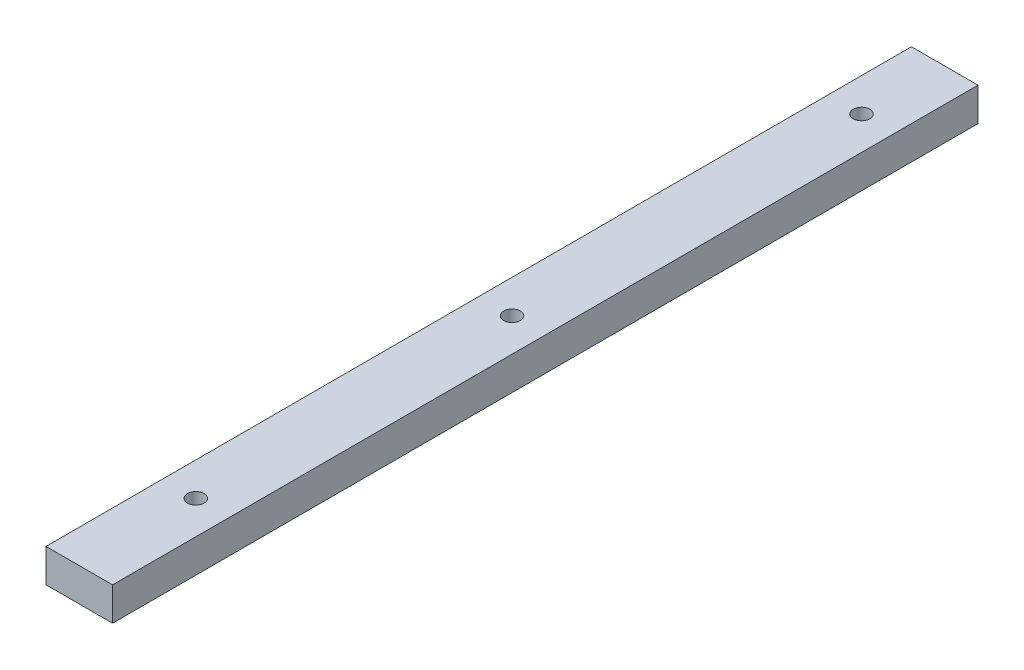
ISO-10303-21;
HEADER;
FILE_DESCRIPTION(('STEP AP214'),'2;1');
FILE_NAME('part.step','',(''),(''),'','','');
FILE_SCHEMA(('AUTOMOTIVE_DESIGN { 1 0 10303 214 1 1 1 1 }'));
ENDSEC;
DATA;
#1=APPLICATION_CONTEXT('core data for automotive mechanical design processes');
#2=APPLICATION_PROTOCOL_DEFINITION('international standard','automotive_design',2000,#1);
#3=PRODUCT_CONTEXT('',#1,'mechanical');
#4=PRODUCT('Part','Part','',(#3));
#5=PRODUCT_RELATED_PRODUCT_CATEGORY('part','',(#4));
#6=PRODUCT_DEFINITION_FORMATION('','',#4);
#7=PRODUCT_DEFINITION_CONTEXT('part definition',#1,'design');
#8=PRODUCT_DEFINITION('design','',#6,#7);
#9=PRODUCT_DEFINITION_SHAPE('','',#8);
#10=(LENGTH_UNIT() NAMED_UNIT(*) SI_UNIT(.MILLI.,.METRE.));
#11=(NAMED_UNIT(*) PLANE_ANGLE_UNIT() SI_UNIT($,.RADIAN.));
#12=(NAMED_UNIT(*) SI_UNIT($,.STERADIAN.) SOLID_ANGLE_UNIT());
#13=UNCERTAINTY_MEASURE_WITH_UNIT(LENGTH_MEASURE(1.E-05),#10,'distance_accuracy_value','');
#14=(GEOMETRIC_REPRESENTATION_CONTEXT(3) GLOBAL_UNCERTAINTY_ASSIGNED_CONTEXT((#13)) GLOBAL_UNIT_ASSIGNED_CONTEXT((#10,
#11,#12)) REPRESENTATION_CONTEXT('',''));
#15=CARTESIAN_POINT('',(0.,0.,0.));
#16=DIRECTION('',(0.,0.,1.));
#17=DIRECTION('',(1.,0.,0.));
#18=AXIS2_PLACEMENT_3D('',#15,#16,#17);
#19=CARTESIAN_POINT('',(0.,0.,660.4));
#20=DIRECTION('',(1.,0.,0.));
#21=DIRECTION('',(0.,0.,-1.));
#22=AXIS2_PLACEMENT_3D('',#19,#20,#21);
#23=PLANE('',#22);
#24=DIRECTION('',(0.,-1.,0.));
#25=VECTOR('',#24,1.);
#26=CARTESIAN_POINT('',(0.,0.,0.));
#27=LINE('',#26,#25);
#28=CARTESIAN_POINT('',(0.,25.4,0.));
#29=VERTEX_POINT('',#28);
#30=CARTESIAN_POINT('',(0.,0.,0.));
#31=VERTEX_POINT('',#30);
#32=EDGE_CURVE('E96',#29,#31,#27,.T.);
#33=ORIENTED_EDGE('',*,*,#32,.T.);
#34=DIRECTION('',(0.,0.,-1.));
#35=VECTOR('',#34,1.);
#36=CARTESIAN_POINT('',(0.,0.,660.4));
#37=LINE('',#36,#35);
#38=CARTESIAN_POINT('',(0.,0.,660.4));
#39=VERTEX_POINT('',#38);
#40=EDGE_CURVE('E11',#39,#31,#37,.T.);
#41=ORIENTED_EDGE('',*,*,#40,.F.);
#42=DIRECTION('',(0.,-1.,0.));
#43=VECTOR('',#42,1.);
#44=CARTESIAN_POINT('',(0.,0.,660.4));
#45=LINE('',#44,#43);
#46=CARTESIAN_POINT('',(0.,25.4,660.4));
#47=VERTEX_POINT('',#46);
#48=EDGE_CURVE('E84',#47,#39,#45,.T.);
#49=ORIENTED_EDGE('',*,*,#48,.F.);
#50=DIRECTION('',(0.,0.,-1.));
#51=VECTOR('',#50,1.);
#52=CARTESIAN_POINT('',(0.,25.4,660.4));
#53=LINE('',#52,#51);
#54=EDGE_CURVE('E92',#47,#29,#53,.T.);
#55=ORIENTED_EDGE('',*,*,#54,.T.);
#56=EDGE_LOOP('',(#33,#41,#49,#55));
#57=FACE_BOUND('',#56,.T.);
#58=ADVANCED_FACE('F33',(#57),#23,.F.);
#59=CARTESIAN_POINT('',(0.,0.,660.4));
#60=DIRECTION('',(0.,1.,0.));
#61=DIRECTION('',(0.,0.,1.));
#62=AXIS2_PLACEMENT_3D('',#59,#60,#61);
#63=PLANE('',#62);
#64=CARTESIAN_POINT('',(25.4,0.,63.5));
#65=DIRECTION('',(0.,1.,0.));
#66=DIRECTION('',(0.,0.,1.));
#67=AXIS2_PLACEMENT_3D('',#64,#65,#66);
#68=CIRCLE('',#67,6.35);
#69=CARTESIAN_POINT('',(25.4,0.,69.85));
#70=VERTEX_POINT('',#69);
#71=EDGE_CURVE('E99',#70,#70,#68,.T.);
#72=ORIENTED_EDGE('',*,*,#71,.T.);
#73=EDGE_LOOP('',(#72));
#74=FACE_BOUND('',#73,.T.);
#75=CARTESIAN_POINT('',(25.4000000000001,0.,571.5));
#76=DIRECTION('',(0.,1.,0.));
#77=DIRECTION('',(0.,0.,1.));
#78=AXIS2_PLACEMENT_3D('',#75,#76,#77);
#79=CIRCLE('',#78,6.34999999999999);
#80=CARTESIAN_POINT('',(25.4000000000001,0.,577.85));
#81=VERTEX_POINT('',#80);
#82=EDGE_CURVE('E112',#81,#81,#79,.T.);
#83=ORIENTED_EDGE('',*,*,#82,.T.);
#84=EDGE_LOOP('',(#83));
#85=FACE_BOUND('',#84,.T.);
#86=CARTESIAN_POINT('',(25.4,0.,330.2));
#87=DIRECTION('',(0.,1.,0.));
#88=DIRECTION('',(0.,0.,1.));
#89=AXIS2_PLACEMENT_3D('',#86,#87,#88);
#90=CIRCLE('',#89,6.35);
#91=CARTESIAN_POINT('',(25.4,0.,336.55));
#92=VERTEX_POINT('',#91);
#93=EDGE_CURVE('E115',#92,#92,#90,.T.);
#94=ORIENTED_EDGE('',*,*,#93,.T.);
#95=EDGE_LOOP('',(#94));
#96=FACE_BOUND('',#95,.T.);
#97=DIRECTION('',(1.,0.,0.));
#98=VECTOR('',#97,1.);
#99=CARTESIAN_POINT('',(0.,0.,0.));
#100=LINE('',#99,#98);
#101=CARTESIAN_POINT('',(50.8,0.,0.));
#102=VERTEX_POINT('',#101);
#103=EDGE_CURVE('E88',#31,#102,#100,.T.);
#104=ORIENTED_EDGE('',*,*,#103,.T.);
#105=DIRECTION('',(0.,0.,-1.));
#106=VECTOR('',#105,1.);
#107=CARTESIAN_POINT('',(50.8,0.,660.4));
#108=LINE('',#107,#106);
#109=CARTESIAN_POINT('',(50.8,0.,660.4));
#110=VERTEX_POINT('',#109);
#111=EDGE_CURVE('E41',#110,#102,#108,.T.);
#112=ORIENTED_EDGE('',*,*,#111,.F.);
#113=DIRECTION('',(1.,0.,0.));
#114=VECTOR('',#113,1.);
#115=CARTESIAN_POINT('',(0.,0.,660.4));
#116=LINE('',#115,#114);
#117=EDGE_CURVE('E79',#39,#110,#116,.T.);
#118=ORIENTED_EDGE('',*,*,#117,.F.);
#119=ORIENTED_EDGE('',*,*,#40,.T.);
#120=EDGE_LOOP('',(#104,#112,#118,#119));
#121=FACE_BOUND('',#120,.T.);
#122=ADVANCED_FACE('F87',(#74,#85,#96,#121),#63,.F.);
#123=CARTESIAN_POINT('',(50.8,0.,660.4));
#124=DIRECTION('',(-1.,0.,0.));
#125=DIRECTION('',(0.,0.,1.));
#126=AXIS2_PLACEMENT_3D('',#123,#124,#125);
#127=PLANE('',#126);
#128=DIRECTION('',(0.,1.,0.));
#129=VECTOR('',#128,1.);
#130=CARTESIAN_POINT('',(50.8,0.,0.));
#131=LINE('',#130,#129);
#132=CARTESIAN_POINT('',(50.8,25.4,0.));
#133=VERTEX_POINT('',#132);
#134=EDGE_CURVE('E66',#102,#133,#131,.T.);
#135=ORIENTED_EDGE('',*,*,#134,.T.);
#136=DIRECTION('',(0.,0.,-1.));
#137=VECTOR('',#136,1.);
#138=CARTESIAN_POINT('',(50.8,25.4,660.4));
#139=LINE('',#138,#137);
#140=CARTESIAN_POINT('',(50.8,25.4,660.4));
#141=VERTEX_POINT('',#140);
#142=EDGE_CURVE('E89',#141,#133,#139,.T.);
#143=ORIENTED_EDGE('',*,*,#142,.F.);
#144=DIRECTION('',(0.,1.,0.));
#145=VECTOR('',#144,1.);
#146=CARTESIAN_POINT('',(50.8,0.,660.4));
#147=LINE('',#146,#145);
#148=EDGE_CURVE('E82',#110,#141,#147,.T.);
#149=ORIENTED_EDGE('',*,*,#148,.F.);
#150=ORIENTED_EDGE('',*,*,#111,.T.);
#151=EDGE_LOOP('',(#135,#143,#149,#150));
#152=FACE_BOUND('',#151,.T.);
#153=ADVANCED_FACE('F90',(#152),#127,.F.);
#154=CARTESIAN_POINT('',(0.,25.4,660.4));
#155=DIRECTION('',(0.,-1.,0.));
#156=DIRECTION('',(0.,0.,-1.));
#157=AXIS2_PLACEMENT_3D('',#154,#155,#156);
#158=PLANE('',#157);
#159=CARTESIAN_POINT('',(25.4,25.4,63.5));
#160=DIRECTION('',(0.,1.,0.));
#161=DIRECTION('',(0.,0.,1.));
#162=AXIS2_PLACEMENT_3D('',#159,#160,#161);
#163=CIRCLE('',#162,6.35);
#164=CARTESIAN_POINT('',(25.4,25.4,69.85));
#165=VERTEX_POINT('',#164);
#166=EDGE_CURVE('E118',#165,#165,#163,.T.);
#167=ORIENTED_EDGE('',*,*,#166,.F.);
#168=EDGE_LOOP('',(#167));
#169=FACE_BOUND('',#168,.T.);
#170=CARTESIAN_POINT('',(25.4000000000001,25.4,571.5));
#171=DIRECTION('',(0.,1.,0.));
#172=DIRECTION('',(0.,0.,1.));
#173=AXIS2_PLACEMENT_3D('',#170,#171,#172);
#174=CIRCLE('',#173,6.34999999999999);
#175=CARTESIAN_POINT('',(25.4000000000001,25.4,577.85));
#176=VERTEX_POINT('',#175);
#177=EDGE_CURVE('E122',#176,#176,#174,.T.);
#178=ORIENTED_EDGE('',*,*,#177,.F.);
#179=EDGE_LOOP('',(#178));
#180=FACE_BOUND('',#179,.T.);
#181=CARTESIAN_POINT('',(25.4,25.4,330.2));
#182=DIRECTION('',(0.,1.,0.));
#183=DIRECTION('',(0.,0.,1.));
#184=AXIS2_PLACEMENT_3D('',#181,#182,#183);
#185=CIRCLE('',#184,6.35);
#186=CARTESIAN_POINT('',(25.4,25.4,336.55));
#187=VERTEX_POINT('',#186);
#188=EDGE_CURVE('E119',#187,#187,#185,.T.);
#189=ORIENTED_EDGE('',*,*,#188,.F.);
#190=EDGE_LOOP('',(#189));
#191=FACE_BOUND('',#190,.T.);
#192=DIRECTION('',(-1.,0.,0.));
#193=VECTOR('',#192,1.);
#194=CARTESIAN_POINT('',(0.,25.4,0.));
#195=LINE('',#194,#193);
#196=EDGE_CURVE('E72',#133,#29,#195,.T.);
#197=ORIENTED_EDGE('',*,*,#196,.T.);
#198=ORIENTED_EDGE('',*,*,#54,.F.);
#199=DIRECTION('',(-1.,0.,0.));
#200=VECTOR('',#199,1.);
#201=CARTESIAN_POINT('',(0.,25.4,660.4));
#202=LINE('',#201,#200);
#203=EDGE_CURVE('E49',#141,#47,#202,.T.);
#204=ORIENTED_EDGE('',*,*,#203,.F.);
#205=ORIENTED_EDGE('',*,*,#142,.T.);
#206=EDGE_LOOP('',(#197,#198,#204,#205));
#207=FACE_BOUND('',#206,.T.);
#208=ADVANCED_FACE('F104',(#169,#180,#191,#207),#158,.F.);
#209=CARTESIAN_POINT('',(0.,0.,660.4));
#210=DIRECTION('',(0.,0.,-1.));
#211=DIRECTION('',(-1.,0.,0.));
#212=AXIS2_PLACEMENT_3D('',#209,#210,#211);
#213=PLANE('',#212);
#214=ORIENTED_EDGE('',*,*,#48,.T.);
#215=ORIENTED_EDGE('',*,*,#117,.T.);
#216=ORIENTED_EDGE('',*,*,#148,.T.);
#217=ORIENTED_EDGE('',*,*,#203,.T.);
#218=EDGE_LOOP('',(#214,#215,#216,#217));
#219=FACE_BOUND('',#218,.T.);
#220=ADVANCED_FACE('F80',(#219),#213,.F.);
#221=CARTESIAN_POINT('',(0.,0.,0.));
#222=DIRECTION('',(0.,0.,-1.));
#223=DIRECTION('',(-1.,0.,0.));
#224=AXIS2_PLACEMENT_3D('',#221,#222,#223);
#225=PLANE('',#224);
#226=ORIENTED_EDGE('',*,*,#32,.F.);
#227=ORIENTED_EDGE('',*,*,#196,.F.);
#228=ORIENTED_EDGE('',*,*,#134,.F.);
#229=ORIENTED_EDGE('',*,*,#103,.F.);
#230=EDGE_LOOP('',(#226,#227,#228,#229));
#231=FACE_BOUND('',#230,.T.);
#232=ADVANCED_FACE('F107',(#231),#225,.T.);
#233=CARTESIAN_POINT('',(25.4,-228.6,330.2));
#234=DIRECTION('',(0.,1.,0.));
#235=DIRECTION('',(0.,0.,1.));
#236=AXIS2_PLACEMENT_3D('',#233,#234,#235);
#237=CYLINDRICAL_SURFACE('',#236,6.35);
#238=ORIENTED_EDGE('',*,*,#188,.T.);
#239=EDGE_LOOP('',(#238));
#240=FACE_BOUND('',#239,.T.);
#241=ORIENTED_EDGE('',*,*,#93,.F.);
#242=EDGE_LOOP('',(#241));
#243=FACE_BOUND('',#242,.T.);
#244=ADVANCED_FACE('F138',(#240,#243),#237,.F.);
#245=CARTESIAN_POINT('',(25.4000000000001,-228.6,571.5));
#246=DIRECTION('',(0.,1.,0.));
#247=DIRECTION('',(0.,0.,1.));
#248=AXIS2_PLACEMENT_3D('',#245,#246,#247);
#249=CYLINDRICAL_SURFACE('',#248,6.34999999999999);
#250=ORIENTED_EDGE('',*,*,#177,.T.);
#251=EDGE_LOOP('',(#250));
#252=FACE_BOUND('',#251,.T.);
#253=ORIENTED_EDGE('',*,*,#82,.F.);
#254=EDGE_LOOP('',(#253));
#255=FACE_BOUND('',#254,.T.);
#256=ADVANCED_FACE('F141',(#252,#255),#249,.F.);
#257=CARTESIAN_POINT('',(25.4,-228.6,63.5));
#258=DIRECTION('',(0.,1.,0.));
#259=DIRECTION('',(0.,0.,1.));
#260=AXIS2_PLACEMENT_3D('',#257,#258,#259);
#261=CYLINDRICAL_SURFACE('',#260,6.35);
#262=ORIENTED_EDGE('',*,*,#166,.T.);
#263=EDGE_LOOP('',(#262));
#264=FACE_BOUND('',#263,.T.);
#265=ORIENTED_EDGE('',*,*,#71,.F.);
#266=EDGE_LOOP('',(#265));
#267=FACE_BOUND('',#266,.T.);
#268=ADVANCED_FACE('F128',(#264,#267),#261,.F.);
#269=CLOSED_SHELL('',(#58,#122,#153,#208,#220,#232,#244,#256,#268));
#270=MANIFOLD_SOLID_BREP('B2',#269);
#271=ADVANCED_BREP_SHAPE_REPRESENTATION('',(#18,#270),#14);
#272=SHAPE_DEFINITION_REPRESENTATION(#9,#271);
ENDSEC;
END-ISO-10303-21;
